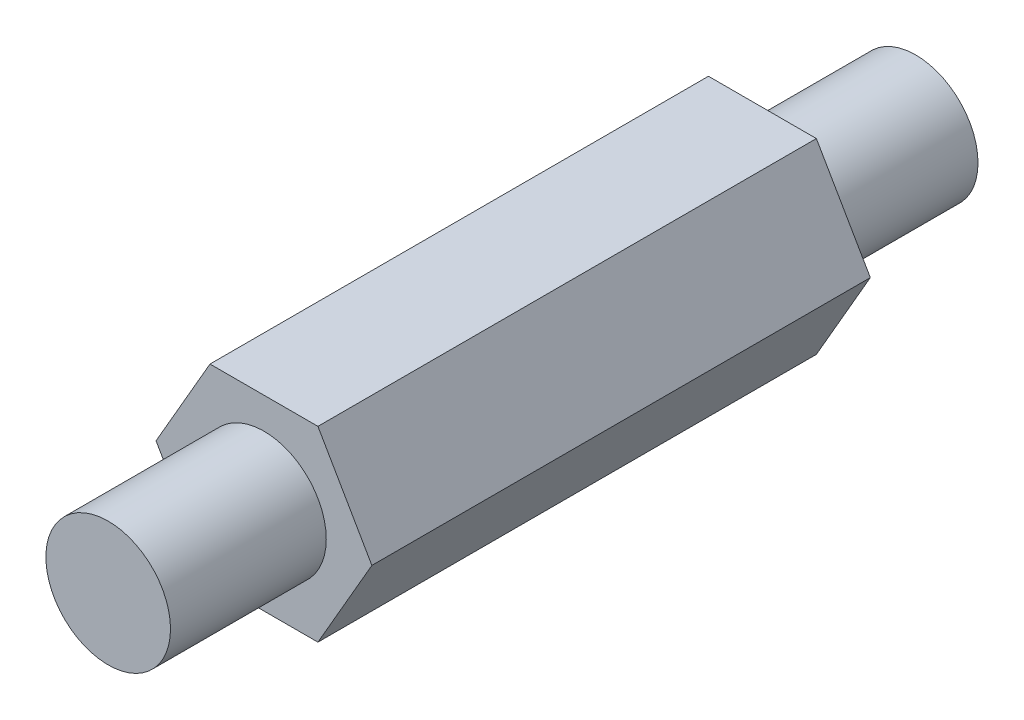
ISO-10303-21;
HEADER;
FILE_DESCRIPTION(('STEP AP214'),'2;1');
FILE_NAME('part.step','',(''),(''),'','','');
FILE_SCHEMA(('AUTOMOTIVE_DESIGN { 1 0 10303 214 1 1 1 1 }'));
ENDSEC;
DATA;
#1=APPLICATION_CONTEXT('core data for automotive mechanical design processes');
#2=APPLICATION_PROTOCOL_DEFINITION('international standard','automotive_design',2000,#1);
#3=PRODUCT_CONTEXT('',#1,'mechanical');
#4=PRODUCT('Part','Part','',(#3));
#5=PRODUCT_RELATED_PRODUCT_CATEGORY('part','',(#4));
#6=PRODUCT_DEFINITION_FORMATION('','',#4);
#7=PRODUCT_DEFINITION_CONTEXT('part definition',#1,'design');
#8=PRODUCT_DEFINITION('design','',#6,#7);
#9=PRODUCT_DEFINITION_SHAPE('','',#8);
#10=(LENGTH_UNIT() NAMED_UNIT(*) SI_UNIT(.MILLI.,.METRE.));
#11=(NAMED_UNIT(*) PLANE_ANGLE_UNIT() SI_UNIT($,.RADIAN.));
#12=(NAMED_UNIT(*) SI_UNIT($,.STERADIAN.) SOLID_ANGLE_UNIT());
#13=UNCERTAINTY_MEASURE_WITH_UNIT(LENGTH_MEASURE(1.E-05),#10,'distance_accuracy_value','');
#14=(GEOMETRIC_REPRESENTATION_CONTEXT(3) GLOBAL_UNCERTAINTY_ASSIGNED_CONTEXT((#13)) GLOBAL_UNIT_ASSIGNED_CONTEXT((#10,
#11,#12)) REPRESENTATION_CONTEXT('',''));
#15=CARTESIAN_POINT('',(0.,0.,0.));
#16=DIRECTION('',(0.,0.,1.));
#17=DIRECTION('',(1.,0.,0.));
#18=AXIS2_PLACEMENT_3D('',#15,#16,#17);
#19=CARTESIAN_POINT('',(-5.49926131403119,0.,41.148));
#20=DIRECTION('',(0.866025403784439,0.5,0.));
#21=DIRECTION('',(-0.5,0.866025403784439,0.));
#22=AXIS2_PLACEMENT_3D('',#19,#20,#21);
#23=PLANE('',#22);
#24=DIRECTION('',(0.,0.,-1.));
#25=VECTOR('',#24,1.);
#26=CARTESIAN_POINT('',(-5.49926131403119,0.,41.148));
#27=LINE('',#26,#25);
#28=CARTESIAN_POINT('',(-5.49926131403119,0.,33.2105));
#29=VERTEX_POINT('',#28);
#30=CARTESIAN_POINT('',(-5.49926131403119,0.,7.8105));
#31=VERTEX_POINT('',#30);
#32=EDGE_CURVE('E102',#29,#31,#27,.T.);
#33=ORIENTED_EDGE('',*,*,#32,.T.);
#34=DIRECTION('',(0.5,-0.866025403784439,0.));
#35=VECTOR('',#34,1.);
#36=CARTESIAN_POINT('',(-5.49926131403119,0.,7.8105));
#37=LINE('',#36,#35);
#38=CARTESIAN_POINT('',(-2.74963065701559,-4.7625,7.8105));
#39=VERTEX_POINT('',#38);
#40=EDGE_CURVE('E49',#31,#39,#37,.T.);
#41=ORIENTED_EDGE('',*,*,#40,.T.);
#42=DIRECTION('',(0.,0.,-1.));
#43=VECTOR('',#42,1.);
#44=CARTESIAN_POINT('',(-2.74963065701559,-4.7625,41.148));
#45=LINE('',#44,#43);
#46=CARTESIAN_POINT('',(-2.74963065701559,-4.7625,33.2105));
#47=VERTEX_POINT('',#46);
#48=EDGE_CURVE('E115',#47,#39,#45,.T.);
#49=ORIENTED_EDGE('',*,*,#48,.F.);
#50=DIRECTION('',(0.5,-0.866025403784439,0.));
#51=VECTOR('',#50,1.);
#52=CARTESIAN_POINT('',(-5.49926131403119,0.,33.2105));
#53=LINE('',#52,#51);
#54=EDGE_CURVE('E106',#29,#47,#53,.T.);
#55=ORIENTED_EDGE('',*,*,#54,.F.);
#56=EDGE_LOOP('',(#33,#41,#49,#55));
#57=FACE_BOUND('',#56,.T.);
#58=ADVANCED_FACE('F35',(#57),#23,.F.);
#59=CARTESIAN_POINT('',(-2.74963065701559,-4.7625,41.148));
#60=DIRECTION('',(0.,1.,0.));
#61=DIRECTION('',(-1.,0.,0.));
#62=AXIS2_PLACEMENT_3D('',#59,#60,#61);
#63=PLANE('',#62);
#64=ORIENTED_EDGE('',*,*,#48,.T.);
#65=DIRECTION('',(1.,0.,0.));
#66=VECTOR('',#65,1.);
#67=CARTESIAN_POINT('',(-2.74963065701559,-4.7625,7.8105));
#68=LINE('',#67,#66);
#69=CARTESIAN_POINT('',(2.74963065701559,-4.7625,7.8105));
#70=VERTEX_POINT('',#69);
#71=EDGE_CURVE('E137',#39,#70,#68,.T.);
#72=ORIENTED_EDGE('',*,*,#71,.T.);
#73=DIRECTION('',(0.,0.,-1.));
#74=VECTOR('',#73,1.);
#75=CARTESIAN_POINT('',(2.74963065701559,-4.7625,41.148));
#76=LINE('',#75,#74);
#77=CARTESIAN_POINT('',(2.74963065701559,-4.7625,33.2105));
#78=VERTEX_POINT('',#77);
#79=EDGE_CURVE('E112',#78,#70,#76,.T.);
#80=ORIENTED_EDGE('',*,*,#79,.F.);
#81=DIRECTION('',(1.,0.,0.));
#82=VECTOR('',#81,1.);
#83=CARTESIAN_POINT('',(-2.74963065701559,-4.7625,33.2105));
#84=LINE('',#83,#82);
#85=EDGE_CURVE('E122',#47,#78,#84,.T.);
#86=ORIENTED_EDGE('',*,*,#85,.F.);
#87=EDGE_LOOP('',(#64,#72,#80,#86));
#88=FACE_BOUND('',#87,.T.);
#89=ADVANCED_FACE('F164',(#88),#63,.F.);
#90=CARTESIAN_POINT('',(2.74963065701559,-4.7625,41.148));
#91=DIRECTION('',(-0.866025403784439,0.5,0.));
#92=DIRECTION('',(-0.5,-0.866025403784439,0.));
#93=AXIS2_PLACEMENT_3D('',#90,#91,#92);
#94=PLANE('',#93);
#95=ORIENTED_EDGE('',*,*,#79,.T.);
#96=DIRECTION('',(0.5,0.866025403784439,0.));
#97=VECTOR('',#96,1.);
#98=CARTESIAN_POINT('',(2.74963065701559,-4.7625,7.8105));
#99=LINE('',#98,#97);
#100=CARTESIAN_POINT('',(5.49926131403119,0.,7.8105));
#101=VERTEX_POINT('',#100);
#102=EDGE_CURVE('E140',#70,#101,#99,.T.);
#103=ORIENTED_EDGE('',*,*,#102,.T.);
#104=DIRECTION('',(0.,0.,-1.));
#105=VECTOR('',#104,1.);
#106=CARTESIAN_POINT('',(5.49926131403119,0.,41.148));
#107=LINE('',#106,#105);
#108=CARTESIAN_POINT('',(5.49926131403119,0.,33.2105));
#109=VERTEX_POINT('',#108);
#110=EDGE_CURVE('E104',#109,#101,#107,.T.);
#111=ORIENTED_EDGE('',*,*,#110,.F.);
#112=DIRECTION('',(0.5,0.866025403784439,0.));
#113=VECTOR('',#112,1.);
#114=CARTESIAN_POINT('',(2.74963065701559,-4.7625,33.2105));
#115=LINE('',#114,#113);
#116=EDGE_CURVE('E123',#78,#109,#115,.T.);
#117=ORIENTED_EDGE('',*,*,#116,.F.);
#118=EDGE_LOOP('',(#95,#103,#111,#117));
#119=FACE_BOUND('',#118,.T.);
#120=ADVANCED_FACE('F169',(#119),#94,.F.);
#121=CARTESIAN_POINT('',(5.49926131403119,0.,41.148));
#122=DIRECTION('',(-0.866025403784439,-0.5,0.));
#123=DIRECTION('',(0.5,-0.866025403784439,0.));
#124=AXIS2_PLACEMENT_3D('',#121,#122,#123);
#125=PLANE('',#124);
#126=ORIENTED_EDGE('',*,*,#110,.T.);
#127=DIRECTION('',(-0.5,0.866025403784439,0.));
#128=VECTOR('',#127,1.);
#129=CARTESIAN_POINT('',(5.49926131403119,0.,7.8105));
#130=LINE('',#129,#128);
#131=CARTESIAN_POINT('',(2.74963065701559,4.7625,7.8105));
#132=VERTEX_POINT('',#131);
#133=EDGE_CURVE('E98',#101,#132,#130,.T.);
#134=ORIENTED_EDGE('',*,*,#133,.T.);
#135=DIRECTION('',(0.,0.,-1.));
#136=VECTOR('',#135,1.);
#137=CARTESIAN_POINT('',(2.74963065701559,4.7625,41.148));
#138=LINE('',#137,#136);
#139=CARTESIAN_POINT('',(2.74963065701559,4.7625,33.2105));
#140=VERTEX_POINT('',#139);
#141=EDGE_CURVE('E97',#140,#132,#138,.T.);
#142=ORIENTED_EDGE('',*,*,#141,.F.);
#143=DIRECTION('',(-0.5,0.866025403784439,0.));
#144=VECTOR('',#143,1.);
#145=CARTESIAN_POINT('',(5.49926131403119,0.,33.2105));
#146=LINE('',#145,#144);
#147=EDGE_CURVE('E127',#109,#140,#146,.T.);
#148=ORIENTED_EDGE('',*,*,#147,.F.);
#149=EDGE_LOOP('',(#126,#134,#142,#148));
#150=FACE_BOUND('',#149,.T.);
#151=ADVANCED_FACE('F174',(#150),#125,.F.);
#152=CARTESIAN_POINT('',(2.74963065701559,4.7625,41.148));
#153=DIRECTION('',(0.,-1.,0.));
#154=DIRECTION('',(1.,0.,0.));
#155=AXIS2_PLACEMENT_3D('',#152,#153,#154);
#156=PLANE('',#155);
#157=ORIENTED_EDGE('',*,*,#141,.T.);
#158=DIRECTION('',(-1.,0.,0.));
#159=VECTOR('',#158,1.);
#160=CARTESIAN_POINT('',(2.74963065701559,4.7625,7.8105));
#161=LINE('',#160,#159);
#162=CARTESIAN_POINT('',(-2.74963065701559,4.7625,7.8105));
#163=VERTEX_POINT('',#162);
#164=EDGE_CURVE('E85',#132,#163,#161,.T.);
#165=ORIENTED_EDGE('',*,*,#164,.T.);
#166=DIRECTION('',(0.,0.,-1.));
#167=VECTOR('',#166,1.);
#168=CARTESIAN_POINT('',(-2.74963065701559,4.7625,41.148));
#169=LINE('',#168,#167);
#170=CARTESIAN_POINT('',(-2.74963065701559,4.7625,33.2105));
#171=VERTEX_POINT('',#170);
#172=EDGE_CURVE('E95',#171,#163,#169,.T.);
#173=ORIENTED_EDGE('',*,*,#172,.F.);
#174=DIRECTION('',(-1.,0.,0.));
#175=VECTOR('',#174,1.);
#176=CARTESIAN_POINT('',(2.74963065701559,4.7625,33.2105));
#177=LINE('',#176,#175);
#178=EDGE_CURVE('E56',#140,#171,#177,.T.);
#179=ORIENTED_EDGE('',*,*,#178,.F.);
#180=EDGE_LOOP('',(#157,#165,#173,#179));
#181=FACE_BOUND('',#180,.T.);
#182=ADVANCED_FACE('F94',(#181),#156,.F.);
#183=CARTESIAN_POINT('',(-2.74963065701559,4.7625,41.148));
#184=DIRECTION('',(0.866025403784439,-0.5,0.));
#185=DIRECTION('',(0.5,0.866025403784439,0.));
#186=AXIS2_PLACEMENT_3D('',#183,#184,#185);
#187=PLANE('',#186);
#188=ORIENTED_EDGE('',*,*,#172,.T.);
#189=DIRECTION('',(-0.5,-0.866025403784439,0.));
#190=VECTOR('',#189,1.);
#191=CARTESIAN_POINT('',(-2.74963065701559,4.7625,7.8105));
#192=LINE('',#191,#190);
#193=EDGE_CURVE('E12',#163,#31,#192,.T.);
#194=ORIENTED_EDGE('',*,*,#193,.T.);
#195=ORIENTED_EDGE('',*,*,#32,.F.);
#196=DIRECTION('',(-0.5,-0.866025403784439,0.));
#197=VECTOR('',#196,1.);
#198=CARTESIAN_POINT('',(-2.74963065701559,4.7625,33.2105));
#199=LINE('',#198,#197);
#200=EDGE_CURVE('E42',#171,#29,#199,.T.);
#201=ORIENTED_EDGE('',*,*,#200,.F.);
#202=EDGE_LOOP('',(#188,#194,#195,#201));
#203=FACE_BOUND('',#202,.T.);
#204=ADVANCED_FACE('F101',(#203),#187,.F.);
#205=CARTESIAN_POINT('',(0.,0.,33.2105));
#206=DIRECTION('',(0.,0.,1.));
#207=DIRECTION('',(1.,0.,0.));
#208=AXIS2_PLACEMENT_3D('',#205,#206,#207);
#209=PLANE('',#208);
#210=CARTESIAN_POINT('',(0.,0.,33.2105));
#211=DIRECTION('',(0.,0.,1.));
#212=DIRECTION('',(1.,0.,0.));
#213=AXIS2_PLACEMENT_3D('',#210,#211,#212);
#214=CIRCLE('',#213,3.175);
#215=CARTESIAN_POINT('',(3.175,0.,33.2105));
#216=VERTEX_POINT('',#215);
#217=EDGE_CURVE('E130',#216,#216,#214,.T.);
#218=ORIENTED_EDGE('',*,*,#217,.F.);
#219=EDGE_LOOP('',(#218));
#220=FACE_BOUND('',#219,.T.);
#221=ORIENTED_EDGE('',*,*,#54,.T.);
#222=ORIENTED_EDGE('',*,*,#85,.T.);
#223=ORIENTED_EDGE('',*,*,#116,.T.);
#224=ORIENTED_EDGE('',*,*,#147,.T.);
#225=ORIENTED_EDGE('',*,*,#178,.T.);
#226=ORIENTED_EDGE('',*,*,#200,.T.);
#227=EDGE_LOOP('',(#221,#222,#223,#224,#225,#226));
#228=FACE_BOUND('',#227,.T.);
#229=ADVANCED_FACE('F118',(#220,#228),#209,.T.);
#230=CARTESIAN_POINT('',(0.,0.,33.2105));
#231=DIRECTION('',(0.,0.,1.));
#232=DIRECTION('',(1.,0.,0.));
#233=AXIS2_PLACEMENT_3D('',#230,#231,#232);
#234=CYLINDRICAL_SURFACE('',#233,3.175);
#235=ORIENTED_EDGE('',*,*,#217,.T.);
#236=EDGE_LOOP('',(#235));
#237=FACE_BOUND('',#236,.T.);
#238=CARTESIAN_POINT('',(0.,0.,41.148));
#239=DIRECTION('',(0.,0.,1.));
#240=DIRECTION('',(1.,0.,0.));
#241=AXIS2_PLACEMENT_3D('',#238,#239,#240);
#242=CIRCLE('',#241,3.175);
#243=CARTESIAN_POINT('',(3.175,0.,41.148));
#244=VERTEX_POINT('',#243);
#245=EDGE_CURVE('E131',#244,#244,#242,.T.);
#246=ORIENTED_EDGE('',*,*,#245,.F.);
#247=EDGE_LOOP('',(#246));
#248=FACE_BOUND('',#247,.T.);
#249=ADVANCED_FACE('F187',(#237,#248),#234,.T.);
#250=CARTESIAN_POINT('',(0.,0.,41.148));
#251=DIRECTION('',(0.,0.,1.));
#252=DIRECTION('',(1.,0.,0.));
#253=AXIS2_PLACEMENT_3D('',#250,#251,#252);
#254=PLANE('',#253);
#255=ORIENTED_EDGE('',*,*,#245,.T.);
#256=EDGE_LOOP('',(#255));
#257=FACE_BOUND('',#256,.T.);
#258=ADVANCED_FACE('F194',(#257),#254,.T.);
#259=CARTESIAN_POINT('',(0.,0.,7.8105));
#260=DIRECTION('',(0.,0.,1.));
#261=DIRECTION('',(1.,0.,0.));
#262=AXIS2_PLACEMENT_3D('',#259,#260,#261);
#263=PLANE('',#262);
#264=CARTESIAN_POINT('',(0.,0.,7.8105));
#265=DIRECTION('',(0.,0.,1.));
#266=DIRECTION('',(1.,0.,0.));
#267=AXIS2_PLACEMENT_3D('',#264,#265,#266);
#268=CIRCLE('',#267,3.175);
#269=CARTESIAN_POINT('',(3.175,0.,7.8105));
#270=VERTEX_POINT('',#269);
#271=EDGE_CURVE('E144',#270,#270,#268,.T.);
#272=ORIENTED_EDGE('',*,*,#271,.T.);
#273=EDGE_LOOP('',(#272));
#274=FACE_BOUND('',#273,.T.);
#275=ORIENTED_EDGE('',*,*,#193,.F.);
#276=ORIENTED_EDGE('',*,*,#164,.F.);
#277=ORIENTED_EDGE('',*,*,#133,.F.);
#278=ORIENTED_EDGE('',*,*,#102,.F.);
#279=ORIENTED_EDGE('',*,*,#71,.F.);
#280=ORIENTED_EDGE('',*,*,#40,.F.);
#281=EDGE_LOOP('',(#275,#276,#277,#278,#279,#280));
#282=FACE_BOUND('',#281,.T.);
#283=ADVANCED_FACE('F84',(#274,#282),#263,.F.);
#284=CARTESIAN_POINT('',(0.,0.,0.));
#285=DIRECTION('',(0.,0.,1.));
#286=DIRECTION('',(1.,0.,0.));
#287=AXIS2_PLACEMENT_3D('',#284,#285,#286);
#288=CYLINDRICAL_SURFACE('',#287,3.175);
#289=CARTESIAN_POINT('',(0.,0.,0.));
#290=DIRECTION('',(0.,0.,1.));
#291=DIRECTION('',(1.,0.,0.));
#292=AXIS2_PLACEMENT_3D('',#289,#290,#291);
#293=CIRCLE('',#292,3.175);
#294=CARTESIAN_POINT('',(3.175,0.,0.));
#295=VERTEX_POINT('',#294);
#296=EDGE_CURVE('E99',#295,#295,#293,.T.);
#297=ORIENTED_EDGE('',*,*,#296,.T.);
#298=EDGE_LOOP('',(#297));
#299=FACE_BOUND('',#298,.T.);
#300=ORIENTED_EDGE('',*,*,#271,.F.);
#301=EDGE_LOOP('',(#300));
#302=FACE_BOUND('',#301,.T.);
#303=ADVANCED_FACE('F150',(#299,#302),#288,.T.);
#304=CARTESIAN_POINT('',(0.,0.,0.));
#305=DIRECTION('',(0.,0.,1.));
#306=DIRECTION('',(1.,0.,0.));
#307=AXIS2_PLACEMENT_3D('',#304,#305,#306);
#308=PLANE('',#307);
#309=ORIENTED_EDGE('',*,*,#296,.F.);
#310=EDGE_LOOP('',(#309));
#311=FACE_BOUND('',#310,.T.);
#312=ADVANCED_FACE('F153',(#311),#308,.F.);
#313=CLOSED_SHELL('',(#58,#89,#120,#151,#182,#204,#229,#249,#258,#283,#303,#312));
#314=MANIFOLD_SOLID_BREP('B2',#313);
#315=ADVANCED_BREP_SHAPE_REPRESENTATION('',(#18,#314),#14);
#316=SHAPE_DEFINITION_REPRESENTATION(#9,#315);
ENDSEC;
END-ISO-10303-21;
